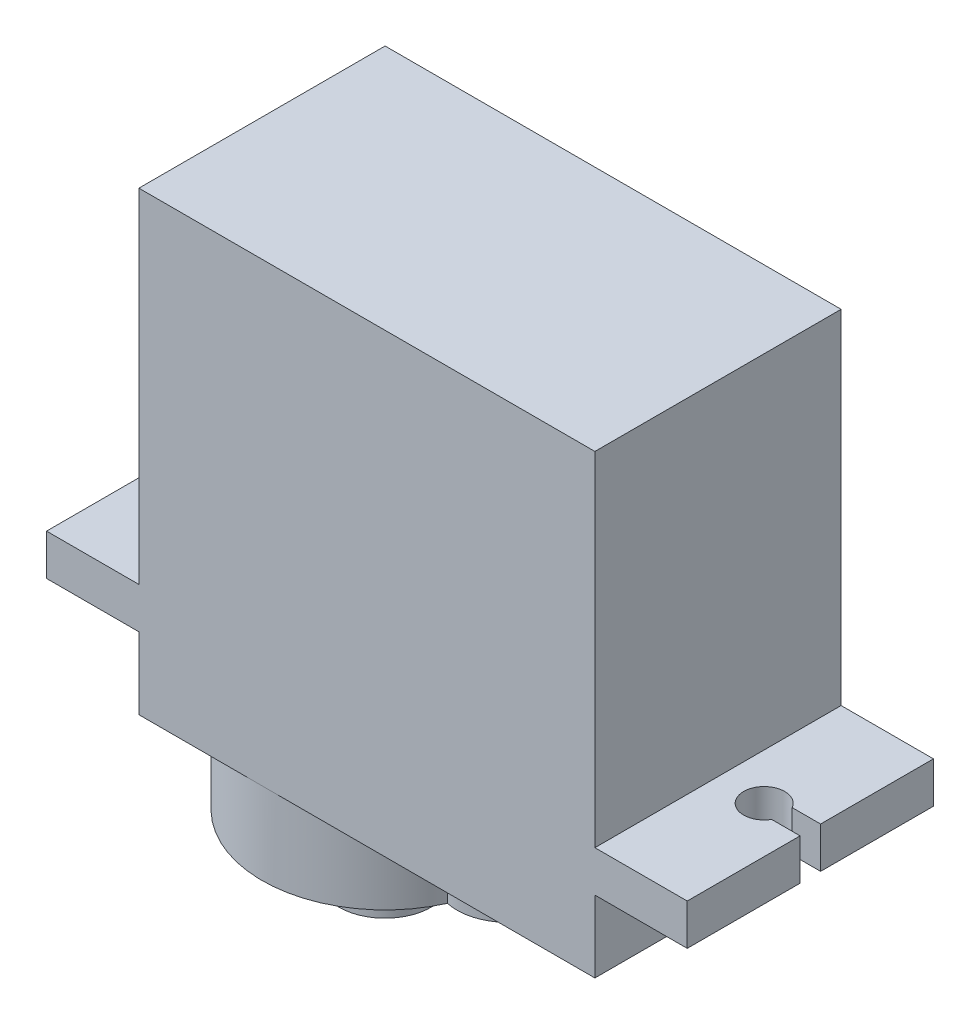
ISO-10303-21;
HEADER;
FILE_DESCRIPTION(('STEP AP214'),'2;1');
FILE_NAME('part.step','',(''),(''),'','','');
FILE_SCHEMA(('AUTOMOTIVE_DESIGN { 1 0 10303 214 1 1 1 1 }'));
ENDSEC;
DATA;
#1=APPLICATION_CONTEXT('core data for automotive mechanical design processes');
#2=APPLICATION_PROTOCOL_DEFINITION('international standard','automotive_design',2000,#1);
#3=PRODUCT_CONTEXT('',#1,'mechanical');
#4=PRODUCT('Part','Part','',(#3));
#5=PRODUCT_RELATED_PRODUCT_CATEGORY('part','',(#4));
#6=PRODUCT_DEFINITION_FORMATION('','',#4);
#7=PRODUCT_DEFINITION_CONTEXT('part definition',#1,'design');
#8=PRODUCT_DEFINITION('design','',#6,#7);
#9=PRODUCT_DEFINITION_SHAPE('','',#8);
#10=(LENGTH_UNIT() NAMED_UNIT(*) SI_UNIT(.MILLI.,.METRE.));
#11=(NAMED_UNIT(*) PLANE_ANGLE_UNIT() SI_UNIT($,.RADIAN.));
#12=(NAMED_UNIT(*) SI_UNIT($,.STERADIAN.) SOLID_ANGLE_UNIT());
#13=UNCERTAINTY_MEASURE_WITH_UNIT(LENGTH_MEASURE(1.E-05),#10,'distance_accuracy_value','');
#14=(GEOMETRIC_REPRESENTATION_CONTEXT(3) GLOBAL_UNCERTAINTY_ASSIGNED_CONTEXT((#13)) GLOBAL_UNIT_ASSIGNED_CONTEXT((#10,
#11,#12)) REPRESENTATION_CONTEXT('',''));
#15=CARTESIAN_POINT('',(0.,0.,0.));
#16=DIRECTION('',(0.,0.,1.));
#17=DIRECTION('',(1.,0.,0.));
#18=AXIS2_PLACEMENT_3D('',#15,#16,#17);
#19=CARTESIAN_POINT('',(-11.1125,11.1125,0.));
#20=DIRECTION('',(-1.,0.,0.));
#21=DIRECTION('',(0.,0.,1.));
#22=AXIS2_PLACEMENT_3D('',#19,#20,#21);
#23=PLANE('',#22);
#24=DIRECTION('',(0.,0.,-1.));
#25=VECTOR('',#24,1.);
#26=CARTESIAN_POINT('',(-11.1125,-5.6125,12.));
#27=LINE('',#26,#25);
#28=CARTESIAN_POINT('',(-11.1125,-5.6125,12.));
#29=VERTEX_POINT('',#28);
#30=CARTESIAN_POINT('',(-11.1125,-5.6125,0.));
#31=VERTEX_POINT('',#30);
#32=EDGE_CURVE('E335',#29,#31,#27,.T.);
#33=ORIENTED_EDGE('',*,*,#32,.F.);
#34=DIRECTION('',(0.,-1.,0.));
#35=VECTOR('',#34,1.);
#36=CARTESIAN_POINT('',(-11.1125,11.1125,12.));
#37=LINE('',#36,#35);
#38=CARTESIAN_POINT('',(-11.1125,11.1125,12.));
#39=VERTEX_POINT('',#38);
#40=EDGE_CURVE('E41',#39,#29,#37,.T.);
#41=ORIENTED_EDGE('',*,*,#40,.F.);
#42=DIRECTION('',(0.,0.,1.));
#43=VECTOR('',#42,1.);
#44=CARTESIAN_POINT('',(-11.1125,11.1125,0.));
#45=LINE('',#44,#43);
#46=CARTESIAN_POINT('',(-11.1125,11.1125,0.));
#47=VERTEX_POINT('',#46);
#48=EDGE_CURVE('E465',#47,#39,#45,.T.);
#49=ORIENTED_EDGE('',*,*,#48,.F.);
#50=DIRECTION('',(0.,-1.,0.));
#51=VECTOR('',#50,1.);
#52=CARTESIAN_POINT('',(-11.1125,11.1125,0.));
#53=LINE('',#52,#51);
#54=EDGE_CURVE('E10',#47,#31,#53,.T.);
#55=ORIENTED_EDGE('',*,*,#54,.T.);
#56=EDGE_LOOP('',(#33,#41,#49,#55));
#57=FACE_BOUND('',#56,.T.);
#58=DIRECTION('',(0.,-1.,0.));
#59=VECTOR('',#58,1.);
#60=CARTESIAN_POINT('',(-11.1125,7.1125,4.5));
#61=LINE('',#60,#59);
#62=CARTESIAN_POINT('',(-11.1125,7.1125,4.5));
#63=VERTEX_POINT('',#62);
#64=CARTESIAN_POINT('',(-11.1125,6.1125,4.5));
#65=VERTEX_POINT('',#64);
#66=EDGE_CURVE('E300',#63,#65,#61,.T.);
#67=ORIENTED_EDGE('',*,*,#66,.F.);
#68=DIRECTION('',(0.,0.,-1.));
#69=VECTOR('',#68,1.);
#70=CARTESIAN_POINT('',(-11.1125,7.1125,7.5));
#71=LINE('',#70,#69);
#72=CARTESIAN_POINT('',(-11.1125,7.1125,7.5));
#73=VERTEX_POINT('',#72);
#74=EDGE_CURVE('E27',#73,#63,#71,.T.);
#75=ORIENTED_EDGE('',*,*,#74,.F.);
#76=DIRECTION('',(0.,1.,0.));
#77=VECTOR('',#76,1.);
#78=CARTESIAN_POINT('',(-11.1125,6.1125,7.5));
#79=LINE('',#78,#77);
#80=CARTESIAN_POINT('',(-11.1125,6.1125,7.5));
#81=VERTEX_POINT('',#80);
#82=EDGE_CURVE('E413',#81,#73,#79,.T.);
#83=ORIENTED_EDGE('',*,*,#82,.F.);
#84=DIRECTION('',(0.,0.,1.));
#85=VECTOR('',#84,1.);
#86=CARTESIAN_POINT('',(-11.1125,6.1125,4.5));
#87=LINE('',#86,#85);
#88=EDGE_CURVE('E345',#65,#81,#87,.T.);
#89=ORIENTED_EDGE('',*,*,#88,.F.);
#90=EDGE_LOOP('',(#67,#75,#83,#89));
#91=FACE_BOUND('',#90,.T.);
#92=ADVANCED_FACE('F16',(#57,#91),#23,.T.);
#93=CARTESIAN_POINT('',(-11.1125,7.1125,7.5));
#94=DIRECTION('',(0.,1.,0.));
#95=DIRECTION('',(0.,0.,-1.));
#96=AXIS2_PLACEMENT_3D('',#93,#94,#95);
#97=PLANE('',#96);
#98=ORIENTED_EDGE('',*,*,#74,.T.);
#99=DIRECTION('',(-1.,0.,0.));
#100=VECTOR('',#99,1.);
#101=CARTESIAN_POINT('',(-11.1125,7.1125,4.5));
#102=LINE('',#101,#100);
#103=CARTESIAN_POINT('',(-12.1125,7.1125,4.5));
#104=VERTEX_POINT('',#103);
#105=EDGE_CURVE('E526',#63,#104,#102,.T.);
#106=ORIENTED_EDGE('',*,*,#105,.T.);
#107=DIRECTION('',(0.,0.,-1.));
#108=VECTOR('',#107,1.);
#109=CARTESIAN_POINT('',(-12.1125,7.1125,7.5));
#110=LINE('',#109,#108);
#111=CARTESIAN_POINT('',(-12.1125,7.1125,7.5));
#112=VERTEX_POINT('',#111);
#113=EDGE_CURVE('E434',#112,#104,#110,.T.);
#114=ORIENTED_EDGE('',*,*,#113,.F.);
#115=DIRECTION('',(-1.,0.,0.));
#116=VECTOR('',#115,1.);
#117=CARTESIAN_POINT('',(-11.1125,7.1125,7.5));
#118=LINE('',#117,#116);
#119=EDGE_CURVE('E506',#73,#112,#118,.T.);
#120=ORIENTED_EDGE('',*,*,#119,.F.);
#121=EDGE_LOOP('',(#98,#106,#114,#120));
#122=FACE_BOUND('',#121,.T.);
#123=ADVANCED_FACE('F545',(#122),#97,.T.);
#124=CARTESIAN_POINT('',(-11.1125,6.1125,7.5));
#125=DIRECTION('',(0.,0.,1.));
#126=DIRECTION('',(1.,0.,0.));
#127=AXIS2_PLACEMENT_3D('',#124,#125,#126);
#128=PLANE('',#127);
#129=ORIENTED_EDGE('',*,*,#82,.T.);
#130=ORIENTED_EDGE('',*,*,#119,.T.);
#131=DIRECTION('',(0.,1.,0.));
#132=VECTOR('',#131,1.);
#133=CARTESIAN_POINT('',(-12.1125,6.1125,7.5));
#134=LINE('',#133,#132);
#135=CARTESIAN_POINT('',(-12.1125,6.1125,7.5));
#136=VERTEX_POINT('',#135);
#137=EDGE_CURVE('E371',#136,#112,#134,.T.);
#138=ORIENTED_EDGE('',*,*,#137,.F.);
#139=DIRECTION('',(-1.,0.,0.));
#140=VECTOR('',#139,1.);
#141=CARTESIAN_POINT('',(-11.1125,6.1125,7.5));
#142=LINE('',#141,#140);
#143=EDGE_CURVE('E341',#81,#136,#142,.T.);
#144=ORIENTED_EDGE('',*,*,#143,.F.);
#145=EDGE_LOOP('',(#129,#130,#138,#144));
#146=FACE_BOUND('',#145,.T.);
#147=ADVANCED_FACE('F541',(#146),#128,.T.);
#148=CARTESIAN_POINT('',(-11.1125,6.1125,4.5));
#149=DIRECTION('',(0.,-1.,0.));
#150=DIRECTION('',(-1.,0.,0.));
#151=AXIS2_PLACEMENT_3D('',#148,#149,#150);
#152=PLANE('',#151);
#153=ORIENTED_EDGE('',*,*,#88,.T.);
#154=ORIENTED_EDGE('',*,*,#143,.T.);
#155=DIRECTION('',(0.,0.,1.));
#156=VECTOR('',#155,1.);
#157=CARTESIAN_POINT('',(-12.1125,6.1125,4.5));
#158=LINE('',#157,#156);
#159=CARTESIAN_POINT('',(-12.1125,6.1125,4.5));
#160=VERTEX_POINT('',#159);
#161=EDGE_CURVE('E366',#160,#136,#158,.T.);
#162=ORIENTED_EDGE('',*,*,#161,.F.);
#163=DIRECTION('',(-1.,0.,0.));
#164=VECTOR('',#163,1.);
#165=CARTESIAN_POINT('',(-11.1125,6.1125,4.5));
#166=LINE('',#165,#164);
#167=EDGE_CURVE('E297',#65,#160,#166,.T.);
#168=ORIENTED_EDGE('',*,*,#167,.F.);
#169=EDGE_LOOP('',(#153,#154,#162,#168));
#170=FACE_BOUND('',#169,.T.);
#171=ADVANCED_FACE('F550',(#170),#152,.T.);
#172=CARTESIAN_POINT('',(-11.1125,7.1125,4.5));
#173=DIRECTION('',(0.,0.,-1.));
#174=DIRECTION('',(0.,-1.,0.));
#175=AXIS2_PLACEMENT_3D('',#172,#173,#174);
#176=PLANE('',#175);
#177=ORIENTED_EDGE('',*,*,#66,.T.);
#178=ORIENTED_EDGE('',*,*,#167,.T.);
#179=DIRECTION('',(0.,-1.,0.));
#180=VECTOR('',#179,1.);
#181=CARTESIAN_POINT('',(-12.1125,7.1125,4.5));
#182=LINE('',#181,#180);
#183=EDGE_CURVE('E370',#104,#160,#182,.T.);
#184=ORIENTED_EDGE('',*,*,#183,.F.);
#185=ORIENTED_EDGE('',*,*,#105,.F.);
#186=EDGE_LOOP('',(#177,#178,#184,#185));
#187=FACE_BOUND('',#186,.T.);
#188=ADVANCED_FACE('F829',(#187),#176,.T.);
#189=CARTESIAN_POINT('',(-11.1125,-5.6125,12.));
#190=DIRECTION('',(0.,1.,0.));
#191=DIRECTION('',(1.,0.,0.));
#192=AXIS2_PLACEMENT_3D('',#189,#190,#191);
#193=PLANE('',#192);
#194=DIRECTION('',(1.,0.,0.));
#195=VECTOR('',#194,1.);
#196=CARTESIAN_POINT('',(-14.2285254037844,-5.6125,5.5));
#197=LINE('',#196,#195);
#198=CARTESIAN_POINT('',(-15.6125,-5.6125,5.5));
#199=VERTEX_POINT('',#198);
#200=CARTESIAN_POINT('',(-14.2285254037844,-5.6125,5.5));
#201=VERTEX_POINT('',#200);
#202=EDGE_CURVE('E301',#199,#201,#197,.T.);
#203=ORIENTED_EDGE('',*,*,#202,.T.);
#204=CARTESIAN_POINT('',(-13.3625,-5.6125,6.));
#205=DIRECTION('',(0.,-1.,0.));
#206=DIRECTION('',(-0.866025403784439,0.,-0.5));
#207=AXIS2_PLACEMENT_3D('',#204,#205,#206);
#208=CIRCLE('',#207,1.);
#209=CARTESIAN_POINT('',(-14.2285254037844,-5.6125,6.5));
#210=VERTEX_POINT('',#209);
#211=EDGE_CURVE('E440',#201,#210,#208,.T.);
#212=ORIENTED_EDGE('',*,*,#211,.T.);
#213=DIRECTION('',(-1.,0.,0.));
#214=VECTOR('',#213,1.);
#215=CARTESIAN_POINT('',(-15.6125,-5.6125,6.5));
#216=LINE('',#215,#214);
#217=CARTESIAN_POINT('',(-15.6125,-5.6125,6.5));
#218=VERTEX_POINT('',#217);
#219=EDGE_CURVE('E339',#210,#218,#216,.T.);
#220=ORIENTED_EDGE('',*,*,#219,.T.);
#221=DIRECTION('',(0.,0.,-1.));
#222=VECTOR('',#221,1.);
#223=CARTESIAN_POINT('',(-15.6125,-5.6125,12.));
#224=LINE('',#223,#222);
#225=CARTESIAN_POINT('',(-15.6125,-5.6125,12.));
#226=VERTEX_POINT('',#225);
#227=EDGE_CURVE('E377',#226,#218,#224,.T.);
#228=ORIENTED_EDGE('',*,*,#227,.F.);
#229=DIRECTION('',(-1.,0.,0.));
#230=VECTOR('',#229,1.);
#231=CARTESIAN_POINT('',(-11.1125,-5.6125,12.));
#232=LINE('',#231,#230);
#233=EDGE_CURVE('E445',#29,#226,#232,.T.);
#234=ORIENTED_EDGE('',*,*,#233,.F.);
#235=ORIENTED_EDGE('',*,*,#32,.T.);
#236=DIRECTION('',(-1.,0.,0.));
#237=VECTOR('',#236,1.);
#238=CARTESIAN_POINT('',(-11.1125,-5.6125,0.));
#239=LINE('',#238,#237);
#240=CARTESIAN_POINT('',(-15.6125,-5.6125,0.));
#241=VERTEX_POINT('',#240);
#242=EDGE_CURVE('E340',#31,#241,#239,.T.);
#243=ORIENTED_EDGE('',*,*,#242,.T.);
#244=DIRECTION('',(0.,0.,-1.));
#245=VECTOR('',#244,1.);
#246=CARTESIAN_POINT('',(-15.6125,-5.6125,5.5));
#247=LINE('',#246,#245);
#248=EDGE_CURVE('E361',#199,#241,#247,.T.);
#249=ORIENTED_EDGE('',*,*,#248,.F.);
#250=EDGE_LOOP('',(#203,#212,#220,#228,#234,#235,#243,#249));
#251=FACE_BOUND('',#250,.T.);
#252=ADVANCED_FACE('F897',(#251),#193,.T.);
#253=CARTESIAN_POINT('',(0.,0.,12.));
#254=DIRECTION('',(0.,0.,1.));
#255=DIRECTION('',(1.,0.,0.));
#256=AXIS2_PLACEMENT_3D('',#253,#254,#255);
#257=PLANE('',#256);
#258=ORIENTED_EDGE('',*,*,#40,.T.);
#259=ORIENTED_EDGE('',*,*,#233,.T.);
#260=DIRECTION('',(0.,1.,0.));
#261=VECTOR('',#260,1.);
#262=CARTESIAN_POINT('',(-15.6125,-7.6125,12.));
#263=LINE('',#262,#261);
#264=CARTESIAN_POINT('',(-15.6125,-7.6125,12.));
#265=VERTEX_POINT('',#264);
#266=EDGE_CURVE('E372',#265,#226,#263,.T.);
#267=ORIENTED_EDGE('',*,*,#266,.F.);
#268=DIRECTION('',(-1.,0.,0.));
#269=VECTOR('',#268,1.);
#270=CARTESIAN_POINT('',(-11.1125,-7.6125,12.));
#271=LINE('',#270,#269);
#272=CARTESIAN_POINT('',(-11.1125,-7.6125,12.));
#273=VERTEX_POINT('',#272);
#274=EDGE_CURVE('E357',#273,#265,#271,.T.);
#275=ORIENTED_EDGE('',*,*,#274,.F.);
#276=DIRECTION('',(0.,-1.,0.));
#277=VECTOR('',#276,1.);
#278=CARTESIAN_POINT('',(-11.1125,-7.6125,12.));
#279=LINE('',#278,#277);
#280=CARTESIAN_POINT('',(-11.1125,-11.1125,12.));
#281=VERTEX_POINT('',#280);
#282=EDGE_CURVE('E441',#273,#281,#279,.T.);
#283=ORIENTED_EDGE('',*,*,#282,.T.);
#284=DIRECTION('',(1.,0.,0.));
#285=VECTOR('',#284,1.);
#286=CARTESIAN_POINT('',(-11.1125,-11.1125,12.));
#287=LINE('',#286,#285);
#288=CARTESIAN_POINT('',(-5.1125,-11.1125,12.));
#289=VERTEX_POINT('',#288);
#290=EDGE_CURVE('E295',#281,#289,#287,.T.);
#291=ORIENTED_EDGE('',*,*,#290,.T.);
#292=DIRECTION('',(1.,0.,0.));
#293=VECTOR('',#292,1.);
#294=CARTESIAN_POINT('',(-5.1125,-11.1125,12.));
#295=LINE('',#294,#293);
#296=CARTESIAN_POINT('',(11.1125,-11.1125,12.));
#297=VERTEX_POINT('',#296);
#298=EDGE_CURVE('E274',#289,#297,#295,.T.);
#299=ORIENTED_EDGE('',*,*,#298,.T.);
#300=DIRECTION('',(0.,1.,0.));
#301=VECTOR('',#300,1.);
#302=CARTESIAN_POINT('',(11.1125,-11.1125,12.));
#303=LINE('',#302,#301);
#304=CARTESIAN_POINT('',(11.1125,-7.6125,12.));
#305=VERTEX_POINT('',#304);
#306=EDGE_CURVE('E415',#297,#305,#303,.T.);
#307=ORIENTED_EDGE('',*,*,#306,.T.);
#308=DIRECTION('',(1.,0.,0.));
#309=VECTOR('',#308,1.);
#310=CARTESIAN_POINT('',(11.1125,-7.6125,12.));
#311=LINE('',#310,#309);
#312=CARTESIAN_POINT('',(15.6125,-7.6125,12.));
#313=VERTEX_POINT('',#312);
#314=EDGE_CURVE('E460',#305,#313,#311,.T.);
#315=ORIENTED_EDGE('',*,*,#314,.T.);
#316=DIRECTION('',(0.,-1.,0.));
#317=VECTOR('',#316,1.);
#318=CARTESIAN_POINT('',(15.6125,-5.6125,12.));
#319=LINE('',#318,#317);
#320=CARTESIAN_POINT('',(15.6125,-5.6125,12.));
#321=VERTEX_POINT('',#320);
#322=EDGE_CURVE('E381',#321,#313,#319,.T.);
#323=ORIENTED_EDGE('',*,*,#322,.F.);
#324=DIRECTION('',(1.,0.,0.));
#325=VECTOR('',#324,1.);
#326=CARTESIAN_POINT('',(11.1125,-5.6125,12.));
#327=LINE('',#326,#325);
#328=CARTESIAN_POINT('',(11.1125,-5.6125,12.));
#329=VERTEX_POINT('',#328);
#330=EDGE_CURVE('E365',#329,#321,#327,.T.);
#331=ORIENTED_EDGE('',*,*,#330,.F.);
#332=DIRECTION('',(0.,1.,0.));
#333=VECTOR('',#332,1.);
#334=CARTESIAN_POINT('',(11.1125,-5.6125,12.));
#335=LINE('',#334,#333);
#336=CARTESIAN_POINT('',(11.1125,11.1125,12.));
#337=VERTEX_POINT('',#336);
#338=EDGE_CURVE('E463',#329,#337,#335,.T.);
#339=ORIENTED_EDGE('',*,*,#338,.T.);
#340=DIRECTION('',(-1.,0.,0.));
#341=VECTOR('',#340,1.);
#342=CARTESIAN_POINT('',(11.1125,11.1125,12.));
#343=LINE('',#342,#341);
#344=EDGE_CURVE('E489',#337,#39,#343,.T.);
#345=ORIENTED_EDGE('',*,*,#344,.T.);
#346=EDGE_LOOP('',(#258,#259,#267,#275,#283,#291,#299,#307,#315,#323,#331,#339,#345));
#347=FACE_BOUND('',#346,.T.);
#348=ADVANCED_FACE('F599',(#347),#257,.T.);
#349=CARTESIAN_POINT('',(11.1125,11.1125,0.));
#350=DIRECTION('',(0.,1.,0.));
#351=DIRECTION('',(1.,0.,0.));
#352=AXIS2_PLACEMENT_3D('',#349,#350,#351);
#353=PLANE('',#352);
#354=DIRECTION('',(-1.,0.,0.));
#355=VECTOR('',#354,1.);
#356=CARTESIAN_POINT('',(11.1125,11.1125,0.));
#357=LINE('',#356,#355);
#358=CARTESIAN_POINT('',(11.1125,11.1125,0.));
#359=VERTEX_POINT('',#358);
#360=EDGE_CURVE('E468',#359,#47,#357,.T.);
#361=ORIENTED_EDGE('',*,*,#360,.T.);
#362=ORIENTED_EDGE('',*,*,#48,.T.);
#363=ORIENTED_EDGE('',*,*,#344,.F.);
#364=DIRECTION('',(0.,0.,1.));
#365=VECTOR('',#364,1.);
#366=CARTESIAN_POINT('',(11.1125,11.1125,0.));
#367=LINE('',#366,#365);
#368=EDGE_CURVE('E306',#359,#337,#367,.T.);
#369=ORIENTED_EDGE('',*,*,#368,.F.);
#370=EDGE_LOOP('',(#361,#362,#363,#369));
#371=FACE_BOUND('',#370,.T.);
#372=ADVANCED_FACE('F715',(#371),#353,.T.);
#373=CARTESIAN_POINT('',(0.,0.,0.));
#374=DIRECTION('',(0.,0.,1.));
#375=DIRECTION('',(1.,0.,0.));
#376=AXIS2_PLACEMENT_3D('',#373,#374,#375);
#377=PLANE('',#376);
#378=ORIENTED_EDGE('',*,*,#360,.F.);
#379=DIRECTION('',(0.,1.,0.));
#380=VECTOR('',#379,1.);
#381=CARTESIAN_POINT('',(11.1125,-5.6125,0.));
#382=LINE('',#381,#380);
#383=CARTESIAN_POINT('',(11.1125,-5.6125,0.));
#384=VERTEX_POINT('',#383);
#385=EDGE_CURVE('E331',#384,#359,#382,.T.);
#386=ORIENTED_EDGE('',*,*,#385,.F.);
#387=DIRECTION('',(1.,0.,0.));
#388=VECTOR('',#387,1.);
#389=CARTESIAN_POINT('',(11.1125,-5.6125,0.));
#390=LINE('',#389,#388);
#391=CARTESIAN_POINT('',(15.6125,-5.6125,0.));
#392=VERTEX_POINT('',#391);
#393=EDGE_CURVE('E469',#384,#392,#390,.T.);
#394=ORIENTED_EDGE('',*,*,#393,.T.);
#395=DIRECTION('',(0.,1.,0.));
#396=VECTOR('',#395,1.);
#397=CARTESIAN_POINT('',(15.6125,-7.6125,0.));
#398=LINE('',#397,#396);
#399=CARTESIAN_POINT('',(15.6125,-7.6125,0.));
#400=VERTEX_POINT('',#399);
#401=EDGE_CURVE('E320',#400,#392,#398,.T.);
#402=ORIENTED_EDGE('',*,*,#401,.F.);
#403=DIRECTION('',(1.,0.,0.));
#404=VECTOR('',#403,1.);
#405=CARTESIAN_POINT('',(11.1125,-7.6125,0.));
#406=LINE('',#405,#404);
#407=CARTESIAN_POINT('',(11.1125,-7.6125,0.));
#408=VERTEX_POINT('',#407);
#409=EDGE_CURVE('E455',#408,#400,#406,.T.);
#410=ORIENTED_EDGE('',*,*,#409,.F.);
#411=DIRECTION('',(0.,1.,0.));
#412=VECTOR('',#411,1.);
#413=CARTESIAN_POINT('',(11.1125,-11.1125,0.));
#414=LINE('',#413,#412);
#415=CARTESIAN_POINT('',(11.1125,-11.1125,0.));
#416=VERTEX_POINT('',#415);
#417=EDGE_CURVE('E500',#416,#408,#414,.T.);
#418=ORIENTED_EDGE('',*,*,#417,.F.);
#419=DIRECTION('',(1.,0.,0.));
#420=VECTOR('',#419,1.);
#421=CARTESIAN_POINT('',(-5.1125,-11.1125,0.));
#422=LINE('',#421,#420);
#423=CARTESIAN_POINT('',(-5.1125,-11.1125,0.));
#424=VERTEX_POINT('',#423);
#425=EDGE_CURVE('E409',#424,#416,#422,.T.);
#426=ORIENTED_EDGE('',*,*,#425,.F.);
#427=DIRECTION('',(1.,0.,0.));
#428=VECTOR('',#427,1.);
#429=CARTESIAN_POINT('',(-11.1125,-11.1125,0.));
#430=LINE('',#429,#428);
#431=CARTESIAN_POINT('',(-11.1125,-11.1125,0.));
#432=VERTEX_POINT('',#431);
#433=EDGE_CURVE('E278',#432,#424,#430,.T.);
#434=ORIENTED_EDGE('',*,*,#433,.F.);
#435=DIRECTION('',(0.,-1.,0.));
#436=VECTOR('',#435,1.);
#437=CARTESIAN_POINT('',(-11.1125,-7.6125,0.));
#438=LINE('',#437,#436);
#439=CARTESIAN_POINT('',(-11.1125,-7.6125,0.));
#440=VERTEX_POINT('',#439);
#441=EDGE_CURVE('E385',#440,#432,#438,.T.);
#442=ORIENTED_EDGE('',*,*,#441,.F.);
#443=DIRECTION('',(-1.,0.,0.));
#444=VECTOR('',#443,1.);
#445=CARTESIAN_POINT('',(-11.1125,-7.6125,0.));
#446=LINE('',#445,#444);
#447=CARTESIAN_POINT('',(-15.6125,-7.6125,0.));
#448=VERTEX_POINT('',#447);
#449=EDGE_CURVE('E512',#440,#448,#446,.T.);
#450=ORIENTED_EDGE('',*,*,#449,.T.);
#451=DIRECTION('',(0.,-1.,0.));
#452=VECTOR('',#451,1.);
#453=CARTESIAN_POINT('',(-15.6125,-5.6125,0.));
#454=LINE('',#453,#452);
#455=EDGE_CURVE('E358',#241,#448,#454,.T.);
#456=ORIENTED_EDGE('',*,*,#455,.F.);
#457=ORIENTED_EDGE('',*,*,#242,.F.);
#458=ORIENTED_EDGE('',*,*,#54,.F.);
#459=EDGE_LOOP('',(#378,#386,#394,#402,#410,#418,#426,#434,#442,#450,#456,#457,#458));
#460=FACE_BOUND('',#459,.T.);
#461=ADVANCED_FACE('F605',(#460),#377,.F.);
#462=CARTESIAN_POINT('',(-12.1125,0.,0.));
#463=DIRECTION('',(-1.,0.,0.));
#464=DIRECTION('',(0.,0.,1.));
#465=AXIS2_PLACEMENT_3D('',#462,#463,#464);
#466=PLANE('',#465);
#467=ORIENTED_EDGE('',*,*,#183,.T.);
#468=ORIENTED_EDGE('',*,*,#161,.T.);
#469=ORIENTED_EDGE('',*,*,#137,.T.);
#470=ORIENTED_EDGE('',*,*,#113,.T.);
#471=EDGE_LOOP('',(#467,#468,#469,#470));
#472=FACE_BOUND('',#471,.T.);
#473=ADVANCED_FACE('F548',(#472),#466,.T.);
#474=CARTESIAN_POINT('',(-15.6125,2.3875,5.5));
#475=DIRECTION('',(0.,0.,-1.));
#476=DIRECTION('',(0.,-1.,0.));
#477=AXIS2_PLACEMENT_3D('',#474,#475,#476);
#478=PLANE('',#477);
#479=ORIENTED_EDGE('',*,*,#202,.F.);
#480=DIRECTION('',(0.,1.,0.));
#481=VECTOR('',#480,1.);
#482=CARTESIAN_POINT('',(-15.6125,-5.6125,5.5));
#483=LINE('',#482,#481);
#484=CARTESIAN_POINT('',(-15.6125,-7.6125,5.5));
#485=VERTEX_POINT('',#484);
#486=EDGE_CURVE('E380',#485,#199,#483,.T.);
#487=ORIENTED_EDGE('',*,*,#486,.F.);
#488=DIRECTION('',(-1.,0.,0.));
#489=VECTOR('',#488,1.);
#490=CARTESIAN_POINT('',(-15.6125,-7.6125,5.5));
#491=LINE('',#490,#489);
#492=CARTESIAN_POINT('',(-14.2285254037844,-7.6125,5.5));
#493=VERTEX_POINT('',#492);
#494=EDGE_CURVE('E312',#493,#485,#491,.T.);
#495=ORIENTED_EDGE('',*,*,#494,.F.);
#496=DIRECTION('',(0.,-1.,0.));
#497=VECTOR('',#496,1.);
#498=CARTESIAN_POINT('',(-14.2285254037844,-5.6125,5.5));
#499=LINE('',#498,#497);
#500=EDGE_CURVE('E325',#201,#493,#499,.T.);
#501=ORIENTED_EDGE('',*,*,#500,.F.);
#502=EDGE_LOOP('',(#479,#487,#495,#501));
#503=FACE_BOUND('',#502,.T.);
#504=ADVANCED_FACE('F802',(#503),#478,.F.);
#505=CARTESIAN_POINT('',(-13.3625,2.3875,6.));
#506=DIRECTION('',(0.,-1.,0.));
#507=DIRECTION('',(-0.866025403784439,0.,-0.5));
#508=AXIS2_PLACEMENT_3D('',#505,#506,#507);
#509=CYLINDRICAL_SURFACE('',#508,1.);
#510=ORIENTED_EDGE('',*,*,#211,.F.);
#511=ORIENTED_EDGE('',*,*,#500,.T.);
#512=CARTESIAN_POINT('',(-13.3625,-7.6125,6.));
#513=DIRECTION('',(0.,1.,0.));
#514=DIRECTION('',(-0.866025403784439,0.,-0.5));
#515=AXIS2_PLACEMENT_3D('',#512,#513,#514);
#516=CIRCLE('',#515,1.);
#517=CARTESIAN_POINT('',(-14.2285254037844,-7.6125,6.5));
#518=VERTEX_POINT('',#517);
#519=EDGE_CURVE('E388',#518,#493,#516,.T.);
#520=ORIENTED_EDGE('',*,*,#519,.F.);
#521=DIRECTION('',(0.,-1.,0.));
#522=VECTOR('',#521,1.);
#523=CARTESIAN_POINT('',(-14.2285254037844,-5.6125,6.5));
#524=LINE('',#523,#522);
#525=EDGE_CURVE('E321',#210,#518,#524,.T.);
#526=ORIENTED_EDGE('',*,*,#525,.F.);
#527=EDGE_LOOP('',(#510,#511,#520,#526));
#528=FACE_BOUND('',#527,.T.);
#529=ADVANCED_FACE('F738',(#528),#509,.F.);
#530=CARTESIAN_POINT('',(-14.2285254037844,2.3875,6.5));
#531=DIRECTION('',(0.,0.,1.));
#532=DIRECTION('',(1.,0.,0.));
#533=AXIS2_PLACEMENT_3D('',#530,#531,#532);
#534=PLANE('',#533);
#535=ORIENTED_EDGE('',*,*,#219,.F.);
#536=ORIENTED_EDGE('',*,*,#525,.T.);
#537=DIRECTION('',(1.,0.,0.));
#538=VECTOR('',#537,1.);
#539=CARTESIAN_POINT('',(-14.2285254037844,-7.6125,6.5));
#540=LINE('',#539,#538);
#541=CARTESIAN_POINT('',(-15.6125,-7.6125,6.5));
#542=VERTEX_POINT('',#541);
#543=EDGE_CURVE('E398',#542,#518,#540,.T.);
#544=ORIENTED_EDGE('',*,*,#543,.F.);
#545=DIRECTION('',(0.,-1.,0.));
#546=VECTOR('',#545,1.);
#547=CARTESIAN_POINT('',(-15.6125,-7.6125,6.5));
#548=LINE('',#547,#546);
#549=EDGE_CURVE('E326',#218,#542,#548,.T.);
#550=ORIENTED_EDGE('',*,*,#549,.F.);
#551=EDGE_LOOP('',(#535,#536,#544,#550));
#552=FACE_BOUND('',#551,.T.);
#553=ADVANCED_FACE('F732',(#552),#534,.F.);
#554=CARTESIAN_POINT('',(-15.6125,0.,0.));
#555=DIRECTION('',(-1.,0.,0.));
#556=DIRECTION('',(0.,0.,1.));
#557=AXIS2_PLACEMENT_3D('',#554,#555,#556);
#558=PLANE('',#557);
#559=ORIENTED_EDGE('',*,*,#549,.T.);
#560=DIRECTION('',(0.,0.,1.));
#561=VECTOR('',#560,1.);
#562=CARTESIAN_POINT('',(-15.6125,-7.6125,6.5));
#563=LINE('',#562,#561);
#564=EDGE_CURVE('E376',#542,#265,#563,.T.);
#565=ORIENTED_EDGE('',*,*,#564,.T.);
#566=ORIENTED_EDGE('',*,*,#266,.T.);
#567=ORIENTED_EDGE('',*,*,#227,.T.);
#568=EDGE_LOOP('',(#559,#565,#566,#567));
#569=FACE_BOUND('',#568,.T.);
#570=ADVANCED_FACE('F737',(#569),#558,.T.);
#571=CARTESIAN_POINT('',(-15.6125,0.,0.));
#572=DIRECTION('',(-1.,0.,0.));
#573=DIRECTION('',(0.,0.,1.));
#574=AXIS2_PLACEMENT_3D('',#571,#572,#573);
#575=PLANE('',#574);
#576=ORIENTED_EDGE('',*,*,#486,.T.);
#577=ORIENTED_EDGE('',*,*,#248,.T.);
#578=ORIENTED_EDGE('',*,*,#455,.T.);
#579=DIRECTION('',(0.,0.,1.));
#580=VECTOR('',#579,1.);
#581=CARTESIAN_POINT('',(-15.6125,-7.6125,0.));
#582=LINE('',#581,#580);
#583=EDGE_CURVE('E314',#448,#485,#582,.T.);
#584=ORIENTED_EDGE('',*,*,#583,.T.);
#585=EDGE_LOOP('',(#576,#577,#578,#584));
#586=FACE_BOUND('',#585,.T.);
#587=ADVANCED_FACE('F840',(#586),#575,.T.);
#588=CARTESIAN_POINT('',(-11.1125,-7.6125,0.));
#589=DIRECTION('',(0.,-1.,0.));
#590=DIRECTION('',(-1.,0.,0.));
#591=AXIS2_PLACEMENT_3D('',#588,#589,#590);
#592=PLANE('',#591);
#593=ORIENTED_EDGE('',*,*,#494,.T.);
#594=ORIENTED_EDGE('',*,*,#583,.F.);
#595=ORIENTED_EDGE('',*,*,#449,.F.);
#596=DIRECTION('',(0.,0.,1.));
#597=VECTOR('',#596,1.);
#598=CARTESIAN_POINT('',(-11.1125,-7.6125,0.));
#599=LINE('',#598,#597);
#600=EDGE_CURVE('E315',#440,#273,#599,.T.);
#601=ORIENTED_EDGE('',*,*,#600,.T.);
#602=ORIENTED_EDGE('',*,*,#274,.T.);
#603=ORIENTED_EDGE('',*,*,#564,.F.);
#604=ORIENTED_EDGE('',*,*,#543,.T.);
#605=ORIENTED_EDGE('',*,*,#519,.T.);
#606=EDGE_LOOP('',(#593,#594,#595,#601,#602,#603,#604,#605));
#607=FACE_BOUND('',#606,.T.);
#608=ADVANCED_FACE('F835',(#607),#592,.T.);
#609=CARTESIAN_POINT('',(-11.1125,11.1125,0.));
#610=DIRECTION('',(-1.,0.,0.));
#611=DIRECTION('',(0.,0.,1.));
#612=AXIS2_PLACEMENT_3D('',#609,#610,#611);
#613=PLANE('',#612);
#614=ORIENTED_EDGE('',*,*,#600,.F.);
#615=ORIENTED_EDGE('',*,*,#441,.T.);
#616=DIRECTION('',(0.,0.,1.));
#617=VECTOR('',#616,1.);
#618=CARTESIAN_POINT('',(-11.1125,-11.1125,0.));
#619=LINE('',#618,#617);
#620=CARTESIAN_POINT('',(-11.1125,-11.1125,6.));
#621=VERTEX_POINT('',#620);
#622=EDGE_CURVE('E389',#432,#621,#619,.T.);
#623=ORIENTED_EDGE('',*,*,#622,.T.);
#624=DIRECTION('',(0.,0.,1.));
#625=VECTOR('',#624,1.);
#626=CARTESIAN_POINT('',(-11.1125,-11.1125,6.));
#627=LINE('',#626,#625);
#628=EDGE_CURVE('E401',#621,#281,#627,.T.);
#629=ORIENTED_EDGE('',*,*,#628,.T.);
#630=ORIENTED_EDGE('',*,*,#282,.F.);
#631=EDGE_LOOP('',(#614,#615,#623,#629,#630));
#632=FACE_BOUND('',#631,.T.);
#633=ADVANCED_FACE('F792',(#632),#613,.T.);
#634=CARTESIAN_POINT('',(-11.1125,-11.1125,0.));
#635=DIRECTION('',(0.,-1.,0.));
#636=DIRECTION('',(-1.,0.,0.));
#637=AXIS2_PLACEMENT_3D('',#634,#635,#636);
#638=PLANE('',#637);
#639=CARTESIAN_POINT('',(-5.1125,-11.1125,6.));
#640=DIRECTION('',(0.,-1.,0.));
#641=DIRECTION('',(0.,0.,1.));
#642=AXIS2_PLACEMENT_3D('',#639,#640,#641);
#643=CIRCLE('',#642,6.);
#644=EDGE_CURVE('E279',#289,#621,#643,.T.);
#645=ORIENTED_EDGE('',*,*,#644,.F.);
#646=ORIENTED_EDGE('',*,*,#290,.F.);
#647=ORIENTED_EDGE('',*,*,#628,.F.);
#648=EDGE_LOOP('',(#645,#646,#647));
#649=FACE_BOUND('',#648,.T.);
#650=ADVANCED_FACE('F787',(#649),#638,.T.);
#651=CARTESIAN_POINT('',(-11.1125,-11.1125,0.));
#652=DIRECTION('',(0.,-1.,0.));
#653=DIRECTION('',(-1.,0.,0.));
#654=AXIS2_PLACEMENT_3D('',#651,#652,#653);
#655=PLANE('',#654);
#656=CARTESIAN_POINT('',(0.8875,-11.1125,6.));
#657=DIRECTION('',(0.,-1.,0.));
#658=DIRECTION('',(-0.208333333333334,0.,-0.978057882858792));
#659=AXIS2_PLACEMENT_3D('',#656,#657,#658);
#660=CIRCLE('',#659,2.5);
#661=CARTESIAN_POINT('',(0.366666666666663,-11.1125,3.55485529285302));
#662=VERTEX_POINT('',#661);
#663=CARTESIAN_POINT('',(0.366666666666664,-11.1125,8.44514470714698));
#664=VERTEX_POINT('',#663);
#665=EDGE_CURVE('E255',#662,#664,#660,.T.);
#666=ORIENTED_EDGE('',*,*,#665,.F.);
#667=CARTESIAN_POINT('',(-5.1125,-11.1125,6.));
#668=DIRECTION('',(0.,-1.,0.));
#669=DIRECTION('',(0.,0.,-1.));
#670=AXIS2_PLACEMENT_3D('',#667,#668,#669);
#671=CIRCLE('',#670,6.);
#672=EDGE_CURVE('E472',#424,#662,#671,.T.);
#673=ORIENTED_EDGE('',*,*,#672,.F.);
#674=ORIENTED_EDGE('',*,*,#425,.T.);
#675=DIRECTION('',(0.,0.,1.));
#676=VECTOR('',#675,1.);
#677=CARTESIAN_POINT('',(11.1125,-11.1125,0.));
#678=LINE('',#677,#676);
#679=EDGE_CURVE('E421',#416,#297,#678,.T.);
#680=ORIENTED_EDGE('',*,*,#679,.T.);
#681=ORIENTED_EDGE('',*,*,#298,.F.);
#682=CARTESIAN_POINT('',(-5.1125,-11.1125,6.));
#683=DIRECTION('',(0.,-1.,0.));
#684=DIRECTION('',(0.913194444444444,0.,0.40752411785783));
#685=AXIS2_PLACEMENT_3D('',#682,#683,#684);
#686=CIRCLE('',#685,6.);
#687=EDGE_CURVE('E270',#664,#289,#686,.T.);
#688=ORIENTED_EDGE('',*,*,#687,.F.);
#689=EDGE_LOOP('',(#666,#673,#674,#680,#681,#688));
#690=FACE_BOUND('',#689,.T.);
#691=ADVANCED_FACE('F271',(#690),#655,.T.);
#692=CARTESIAN_POINT('',(11.1125,-11.1125,0.));
#693=DIRECTION('',(1.,0.,0.));
#694=DIRECTION('',(0.,-1.,0.));
#695=AXIS2_PLACEMENT_3D('',#692,#693,#694);
#696=PLANE('',#695);
#697=DIRECTION('',(0.,0.,-1.));
#698=VECTOR('',#697,1.);
#699=CARTESIAN_POINT('',(11.1125,-7.6125,12.));
#700=LINE('',#699,#698);
#701=EDGE_CURVE('E353',#305,#408,#700,.T.);
#702=ORIENTED_EDGE('',*,*,#701,.F.);
#703=ORIENTED_EDGE('',*,*,#306,.F.);
#704=ORIENTED_EDGE('',*,*,#679,.F.);
#705=ORIENTED_EDGE('',*,*,#417,.T.);
#706=EDGE_LOOP('',(#702,#703,#704,#705));
#707=FACE_BOUND('',#706,.T.);
#708=ADVANCED_FACE('F591',(#707),#696,.T.);
#709=CARTESIAN_POINT('',(11.1125,-7.6125,12.));
#710=DIRECTION('',(0.,-1.,0.));
#711=DIRECTION('',(-1.,0.,0.));
#712=AXIS2_PLACEMENT_3D('',#709,#710,#711);
#713=PLANE('',#712);
#714=DIRECTION('',(-1.,0.,0.));
#715=VECTOR('',#714,1.);
#716=CARTESIAN_POINT('',(14.2285254037844,-7.6125,5.5));
#717=LINE('',#716,#715);
#718=CARTESIAN_POINT('',(15.6125,-7.6125,5.5));
#719=VERTEX_POINT('',#718);
#720=CARTESIAN_POINT('',(14.2285254037844,-7.6125,5.5));
#721=VERTEX_POINT('',#720);
#722=EDGE_CURVE('E563',#719,#721,#717,.T.);
#723=ORIENTED_EDGE('',*,*,#722,.T.);
#724=CARTESIAN_POINT('',(13.3625,-7.6125,6.));
#725=DIRECTION('',(0.,1.,0.));
#726=DIRECTION('',(0.866025403784439,0.,0.5));
#727=AXIS2_PLACEMENT_3D('',#724,#725,#726);
#728=CIRCLE('',#727,1.);
#729=CARTESIAN_POINT('',(14.2285254037844,-7.6125,6.5));
#730=VERTEX_POINT('',#729);
#731=EDGE_CURVE('E352',#721,#730,#728,.T.);
#732=ORIENTED_EDGE('',*,*,#731,.T.);
#733=DIRECTION('',(1.,0.,0.));
#734=VECTOR('',#733,1.);
#735=CARTESIAN_POINT('',(15.6125,-7.6125,6.5));
#736=LINE('',#735,#734);
#737=CARTESIAN_POINT('',(15.6125,-7.6125,6.5));
#738=VERTEX_POINT('',#737);
#739=EDGE_CURVE('E348',#730,#738,#736,.T.);
#740=ORIENTED_EDGE('',*,*,#739,.T.);
#741=DIRECTION('',(0.,0.,-1.));
#742=VECTOR('',#741,1.);
#743=CARTESIAN_POINT('',(15.6125,-7.6125,12.));
#744=LINE('',#743,#742);
#745=EDGE_CURVE('E384',#313,#738,#744,.T.);
#746=ORIENTED_EDGE('',*,*,#745,.F.);
#747=ORIENTED_EDGE('',*,*,#314,.F.);
#748=ORIENTED_EDGE('',*,*,#701,.T.);
#749=ORIENTED_EDGE('',*,*,#409,.T.);
#750=DIRECTION('',(0.,0.,-1.));
#751=VECTOR('',#750,1.);
#752=CARTESIAN_POINT('',(15.6125,-7.6125,5.5));
#753=LINE('',#752,#751);
#754=EDGE_CURVE('E307',#719,#400,#753,.T.);
#755=ORIENTED_EDGE('',*,*,#754,.F.);
#756=EDGE_LOOP('',(#723,#732,#740,#746,#747,#748,#749,#755));
#757=FACE_BOUND('',#756,.T.);
#758=ADVANCED_FACE('F596',(#757),#713,.T.);
#759=CARTESIAN_POINT('',(15.6125,0.,0.));
#760=DIRECTION('',(1.,0.,0.));
#761=DIRECTION('',(0.,-1.,0.));
#762=AXIS2_PLACEMENT_3D('',#759,#760,#761);
#763=PLANE('',#762);
#764=DIRECTION('',(0.,1.,0.));
#765=VECTOR('',#764,1.);
#766=CARTESIAN_POINT('',(15.6125,-5.6125,6.5));
#767=LINE('',#766,#765);
#768=CARTESIAN_POINT('',(15.6125,-5.6125,6.5));
#769=VERTEX_POINT('',#768);
#770=EDGE_CURVE('E428',#738,#769,#767,.T.);
#771=ORIENTED_EDGE('',*,*,#770,.T.);
#772=DIRECTION('',(0.,0.,1.));
#773=VECTOR('',#772,1.);
#774=CARTESIAN_POINT('',(15.6125,-5.6125,6.5));
#775=LINE('',#774,#773);
#776=EDGE_CURVE('E383',#769,#321,#775,.T.);
#777=ORIENTED_EDGE('',*,*,#776,.T.);
#778=ORIENTED_EDGE('',*,*,#322,.T.);
#779=ORIENTED_EDGE('',*,*,#745,.T.);
#780=EDGE_LOOP('',(#771,#777,#778,#779));
#781=FACE_BOUND('',#780,.T.);
#782=ADVANCED_FACE('F681',(#781),#763,.T.);
#783=CARTESIAN_POINT('',(11.1125,-5.6125,0.));
#784=DIRECTION('',(0.,1.,0.));
#785=DIRECTION('',(1.,0.,0.));
#786=AXIS2_PLACEMENT_3D('',#783,#784,#785);
#787=PLANE('',#786);
#788=DIRECTION('',(1.,0.,0.));
#789=VECTOR('',#788,1.);
#790=CARTESIAN_POINT('',(15.6125,-5.6125,5.5));
#791=LINE('',#790,#789);
#792=CARTESIAN_POINT('',(14.2285254037844,-5.6125,5.5));
#793=VERTEX_POINT('',#792);
#794=CARTESIAN_POINT('',(15.6125,-5.6125,5.5));
#795=VERTEX_POINT('',#794);
#796=EDGE_CURVE('E20',#793,#795,#791,.T.);
#797=ORIENTED_EDGE('',*,*,#796,.T.);
#798=DIRECTION('',(0.,0.,1.));
#799=VECTOR('',#798,1.);
#800=CARTESIAN_POINT('',(15.6125,-5.6125,0.));
#801=LINE('',#800,#799);
#802=EDGE_CURVE('E497',#392,#795,#801,.T.);
#803=ORIENTED_EDGE('',*,*,#802,.F.);
#804=ORIENTED_EDGE('',*,*,#393,.F.);
#805=DIRECTION('',(0.,0.,1.));
#806=VECTOR('',#805,1.);
#807=CARTESIAN_POINT('',(11.1125,-5.6125,0.));
#808=LINE('',#807,#806);
#809=EDGE_CURVE('E456',#384,#329,#808,.T.);
#810=ORIENTED_EDGE('',*,*,#809,.T.);
#811=ORIENTED_EDGE('',*,*,#330,.T.);
#812=ORIENTED_EDGE('',*,*,#776,.F.);
#813=DIRECTION('',(-1.,0.,0.));
#814=VECTOR('',#813,1.);
#815=CARTESIAN_POINT('',(14.2285254037844,-5.6125,6.5));
#816=LINE('',#815,#814);
#817=CARTESIAN_POINT('',(14.2285254037844,-5.6125,6.5));
#818=VERTEX_POINT('',#817);
#819=EDGE_CURVE('E330',#769,#818,#816,.T.);
#820=ORIENTED_EDGE('',*,*,#819,.T.);
#821=CARTESIAN_POINT('',(13.3625,-5.6125,6.));
#822=DIRECTION('',(0.,-1.,0.));
#823=DIRECTION('',(0.866025403784439,0.,0.5));
#824=AXIS2_PLACEMENT_3D('',#821,#822,#823);
#825=CIRCLE('',#824,1.);
#826=EDGE_CURVE('E327',#818,#793,#825,.T.);
#827=ORIENTED_EDGE('',*,*,#826,.T.);
#828=EDGE_LOOP('',(#797,#803,#804,#810,#811,#812,#820,#827));
#829=FACE_BOUND('',#828,.T.);
#830=ADVANCED_FACE('F623',(#829),#787,.T.);
#831=CARTESIAN_POINT('',(11.1125,-11.1125,0.));
#832=DIRECTION('',(1.,0.,0.));
#833=DIRECTION('',(0.,-1.,0.));
#834=AXIS2_PLACEMENT_3D('',#831,#832,#833);
#835=PLANE('',#834);
#836=ORIENTED_EDGE('',*,*,#809,.F.);
#837=ORIENTED_EDGE('',*,*,#385,.T.);
#838=ORIENTED_EDGE('',*,*,#368,.T.);
#839=ORIENTED_EDGE('',*,*,#338,.F.);
#840=EDGE_LOOP('',(#836,#837,#838,#839));
#841=FACE_BOUND('',#840,.T.);
#842=ADVANCED_FACE('F18',(#841),#835,.T.);
#843=CARTESIAN_POINT('',(15.6125,0.,0.));
#844=DIRECTION('',(1.,0.,0.));
#845=DIRECTION('',(0.,-1.,0.));
#846=AXIS2_PLACEMENT_3D('',#843,#844,#845);
#847=PLANE('',#846);
#848=DIRECTION('',(0.,-1.,0.));
#849=VECTOR('',#848,1.);
#850=CARTESIAN_POINT('',(15.6125,-7.6125,5.5));
#851=LINE('',#850,#849);
#852=EDGE_CURVE('E302',#795,#719,#851,.T.);
#853=ORIENTED_EDGE('',*,*,#852,.T.);
#854=ORIENTED_EDGE('',*,*,#754,.T.);
#855=ORIENTED_EDGE('',*,*,#401,.T.);
#856=ORIENTED_EDGE('',*,*,#802,.T.);
#857=EDGE_LOOP('',(#853,#854,#855,#856));
#858=FACE_BOUND('',#857,.T.);
#859=ADVANCED_FACE('F658',(#858),#847,.T.);
#860=CARTESIAN_POINT('',(-11.1125,-11.1125,0.));
#861=DIRECTION('',(0.,-1.,0.));
#862=DIRECTION('',(-1.,0.,0.));
#863=AXIS2_PLACEMENT_3D('',#860,#861,#862);
#864=PLANE('',#863);
#865=CARTESIAN_POINT('',(-5.1125,-11.1125,6.));
#866=DIRECTION('',(0.,-1.,0.));
#867=DIRECTION('',(-1.,0.,0.));
#868=AXIS2_PLACEMENT_3D('',#865,#866,#867);
#869=CIRCLE('',#868,6.);
#870=EDGE_CURVE('E334',#621,#424,#869,.T.);
#871=ORIENTED_EDGE('',*,*,#870,.F.);
#872=ORIENTED_EDGE('',*,*,#622,.F.);
#873=ORIENTED_EDGE('',*,*,#433,.T.);
#874=EDGE_LOOP('',(#871,#872,#873));
#875=FACE_BOUND('',#874,.T.);
#876=ADVANCED_FACE('F820',(#875),#864,.T.);
#877=CARTESIAN_POINT('',(-5.1125,-11.1125,6.));
#878=DIRECTION('',(0.,-1.,0.));
#879=DIRECTION('',(0.913194444444444,0.,0.40752411785783));
#880=AXIS2_PLACEMENT_3D('',#877,#878,#879);
#881=CYLINDRICAL_SURFACE('',#880,6.);
#882=ORIENTED_EDGE('',*,*,#687,.T.);
#883=ORIENTED_EDGE('',*,*,#644,.T.);
#884=ORIENTED_EDGE('',*,*,#870,.T.);
#885=ORIENTED_EDGE('',*,*,#672,.T.);
#886=DIRECTION('',(0.,-1.,0.));
#887=VECTOR('',#886,1.);
#888=CARTESIAN_POINT('',(0.366666666666662,-11.1125,3.55485529285301));
#889=LINE('',#888,#887);
#890=CARTESIAN_POINT('',(0.366666666666663,-15.1125,3.55485529285302));
#891=VERTEX_POINT('',#890);
#892=EDGE_CURVE('E263',#662,#891,#889,.T.);
#893=ORIENTED_EDGE('',*,*,#892,.T.);
#894=CARTESIAN_POINT('',(-5.1125,-15.1125,6.));
#895=DIRECTION('',(0.,-1.,0.));
#896=DIRECTION('',(0.913194444444444,0.,0.40752411785783));
#897=AXIS2_PLACEMENT_3D('',#894,#895,#896);
#898=CIRCLE('',#897,6.);
#899=CARTESIAN_POINT('',(0.366666666666663,-15.1125,8.44514470714698));
#900=VERTEX_POINT('',#899);
#901=EDGE_CURVE('E282',#900,#891,#898,.T.);
#902=ORIENTED_EDGE('',*,*,#901,.F.);
#903=DIRECTION('',(0.,-1.,0.));
#904=VECTOR('',#903,1.);
#905=CARTESIAN_POINT('',(0.366666666666667,-11.1125,8.44514470714698));
#906=LINE('',#905,#904);
#907=EDGE_CURVE('E260',#664,#900,#906,.T.);
#908=ORIENTED_EDGE('',*,*,#907,.F.);
#909=EDGE_LOOP('',(#882,#883,#884,#885,#893,#902,#908));
#910=FACE_BOUND('',#909,.T.);
#911=ADVANCED_FACE('F281',(#910),#881,.T.);
#912=CARTESIAN_POINT('',(0.8875,-11.1125,6.));
#913=DIRECTION('',(0.,-1.,0.));
#914=DIRECTION('',(-0.208333333333334,0.,-0.978057882858792));
#915=AXIS2_PLACEMENT_3D('',#912,#913,#914);
#916=CYLINDRICAL_SURFACE('',#915,2.5);
#917=ORIENTED_EDGE('',*,*,#665,.T.);
#918=ORIENTED_EDGE('',*,*,#907,.T.);
#919=CARTESIAN_POINT('',(0.8875,-15.1125,6.));
#920=DIRECTION('',(0.,-1.,0.));
#921=DIRECTION('',(-0.208333333333334,0.,-0.978057882858792));
#922=AXIS2_PLACEMENT_3D('',#919,#920,#921);
#923=CIRCLE('',#922,2.5);
#924=EDGE_CURVE('E311',#891,#900,#923,.T.);
#925=ORIENTED_EDGE('',*,*,#924,.F.);
#926=ORIENTED_EDGE('',*,*,#892,.F.);
#927=EDGE_LOOP('',(#917,#918,#925,#926));
#928=FACE_BOUND('',#927,.T.);
#929=ADVANCED_FACE('F257',(#928),#916,.T.);
#930=CARTESIAN_POINT('',(14.2285254037844,2.3875,5.5));
#931=DIRECTION('',(0.,0.,-1.));
#932=DIRECTION('',(0.,-1.,0.));
#933=AXIS2_PLACEMENT_3D('',#930,#931,#932);
#934=PLANE('',#933);
#935=ORIENTED_EDGE('',*,*,#796,.F.);
#936=DIRECTION('',(0.,-1.,0.));
#937=VECTOR('',#936,1.);
#938=CARTESIAN_POINT('',(14.2285254037844,-5.6125,5.5));
#939=LINE('',#938,#937);
#940=EDGE_CURVE('E284',#793,#721,#939,.T.);
#941=ORIENTED_EDGE('',*,*,#940,.T.);
#942=ORIENTED_EDGE('',*,*,#722,.F.);
#943=ORIENTED_EDGE('',*,*,#852,.F.);
#944=EDGE_LOOP('',(#935,#941,#942,#943));
#945=FACE_BOUND('',#944,.T.);
#946=ADVANCED_FACE('F693',(#945),#934,.F.);
#947=CARTESIAN_POINT('',(13.3625,2.3875,6.));
#948=DIRECTION('',(0.,-1.,0.));
#949=DIRECTION('',(0.866025403784439,0.,0.5));
#950=AXIS2_PLACEMENT_3D('',#947,#948,#949);
#951=CYLINDRICAL_SURFACE('',#950,1.);
#952=ORIENTED_EDGE('',*,*,#826,.F.);
#953=DIRECTION('',(0.,-1.,0.));
#954=VECTOR('',#953,1.);
#955=CARTESIAN_POINT('',(14.2285254037844,-5.6125,6.5));
#956=LINE('',#955,#954);
#957=EDGE_CURVE('E291',#818,#730,#956,.T.);
#958=ORIENTED_EDGE('',*,*,#957,.T.);
#959=ORIENTED_EDGE('',*,*,#731,.F.);
#960=ORIENTED_EDGE('',*,*,#940,.F.);
#961=EDGE_LOOP('',(#952,#958,#959,#960));
#962=FACE_BOUND('',#961,.T.);
#963=ADVANCED_FACE('F687',(#962),#951,.F.);
#964=CARTESIAN_POINT('',(15.6125,2.3875,6.5));
#965=DIRECTION('',(0.,0.,1.));
#966=DIRECTION('',(1.,0.,0.));
#967=AXIS2_PLACEMENT_3D('',#964,#965,#966);
#968=PLANE('',#967);
#969=ORIENTED_EDGE('',*,*,#819,.F.);
#970=ORIENTED_EDGE('',*,*,#770,.F.);
#971=ORIENTED_EDGE('',*,*,#739,.F.);
#972=ORIENTED_EDGE('',*,*,#957,.F.);
#973=EDGE_LOOP('',(#969,#970,#971,#972));
#974=FACE_BOUND('',#973,.T.);
#975=ADVANCED_FACE('F692',(#974),#968,.F.);
#976=CARTESIAN_POINT('',(0.,-15.1125,0.));
#977=DIRECTION('',(0.,-1.,0.));
#978=DIRECTION('',(-1.,0.,0.));
#979=AXIS2_PLACEMENT_3D('',#976,#977,#978);
#980=PLANE('',#979);
#981=ORIENTED_EDGE('',*,*,#924,.T.);
#982=ORIENTED_EDGE('',*,*,#901,.T.);
#983=EDGE_LOOP('',(#981,#982));
#984=FACE_BOUND('',#983,.T.);
#985=CARTESIAN_POINT('',(-5.1125,-15.1125,6.));
#986=DIRECTION('',(0.,-1.,0.));
#987=DIRECTION('',(0.,0.,1.));
#988=AXIS2_PLACEMENT_3D('',#985,#986,#987);
#989=CIRCLE('',#988,2.25);
#990=CARTESIAN_POINT('',(-5.1125,-15.1125,8.25));
#991=VERTEX_POINT('',#990);
#992=EDGE_CURVE('E433',#991,#991,#989,.T.);
#993=ORIENTED_EDGE('',*,*,#992,.F.);
#994=EDGE_LOOP('',(#993));
#995=FACE_BOUND('',#994,.T.);
#996=ADVANCED_FACE('F671',(#984,#995),#980,.T.);
#997=CARTESIAN_POINT('',(-5.1125,-15.1125,6.));
#998=DIRECTION('',(0.,-1.,0.));
#999=DIRECTION('',(0.,0.,1.));
#1000=AXIS2_PLACEMENT_3D('',#997,#998,#999);
#1001=CYLINDRICAL_SURFACE('',#1000,2.25);
#1002=CARTESIAN_POINT('',(-5.1125,-18.1125,6.));
#1003=DIRECTION('',(0.,-1.,0.));
#1004=DIRECTION('',(0.,0.,1.));
#1005=AXIS2_PLACEMENT_3D('',#1002,#1003,#1004);
#1006=CIRCLE('',#1005,2.25);
#1007=CARTESIAN_POINT('',(-5.1125,-18.1125,8.25));
#1008=VERTEX_POINT('',#1007);
#1009=EDGE_CURVE('E429',#1008,#1008,#1006,.T.);
#1010=ORIENTED_EDGE('',*,*,#1009,.F.);
#1011=EDGE_LOOP('',(#1010));
#1012=FACE_BOUND('',#1011,.T.);
#1013=ORIENTED_EDGE('',*,*,#992,.T.);
#1014=EDGE_LOOP('',(#1013));
#1015=FACE_BOUND('',#1014,.T.);
#1016=ADVANCED_FACE('F665',(#1012,#1015),#1001,.T.);
#1017=CARTESIAN_POINT('',(0.,-18.1125,0.));
#1018=DIRECTION('',(0.,-1.,0.));
#1019=DIRECTION('',(-1.,0.,0.));
#1020=AXIS2_PLACEMENT_3D('',#1017,#1018,#1019);
#1021=PLANE('',#1020);
#1022=ORIENTED_EDGE('',*,*,#1009,.T.);
#1023=EDGE_LOOP('',(#1022));
#1024=FACE_BOUND('',#1023,.T.);
#1025=ADVANCED_FACE('F670',(#1024),#1021,.T.);
#1026=CLOSED_SHELL('',(#92,#123,#147,#171,#188,#252,#348,#372,#461,#473,#504,#529,#553,#570,
#587,#608,#633,#650,#691,#708,#758,#782,#830,#842,#859,#876,#911,#929,#946,#963,#975,#996,#1016,#1025));
#1027=MANIFOLD_SOLID_BREP('B1',#1026);
#1028=ADVANCED_BREP_SHAPE_REPRESENTATION('',(#18,#1027),#14);
#1029=SHAPE_DEFINITION_REPRESENTATION(#9,#1028);
ENDSEC;
END-ISO-10303-21;
